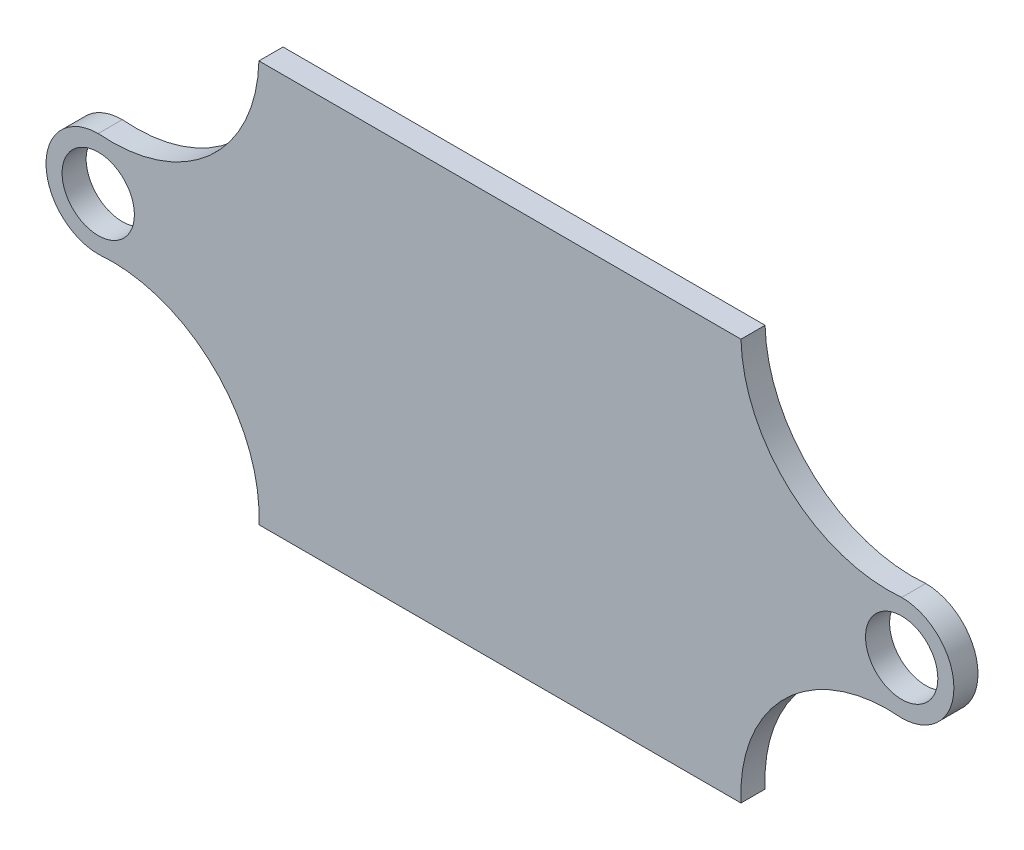
ISO-10303-21;
HEADER;
FILE_DESCRIPTION(('STEP AP214'),'2;1');
FILE_NAME('part.step','',(''),(''),'','','');
FILE_SCHEMA(('AUTOMOTIVE_DESIGN { 1 0 10303 214 1 1 1 1 }'));
ENDSEC;
DATA;
#1=APPLICATION_CONTEXT('core data for automotive mechanical design processes');
#2=APPLICATION_PROTOCOL_DEFINITION('international standard','automotive_design',2000,#1);
#3=PRODUCT_CONTEXT('',#1,'mechanical');
#4=PRODUCT('Part','Part','',(#3));
#5=PRODUCT_RELATED_PRODUCT_CATEGORY('part','',(#4));
#6=PRODUCT_DEFINITION_FORMATION('','',#4);
#7=PRODUCT_DEFINITION_CONTEXT('part definition',#1,'design');
#8=PRODUCT_DEFINITION('design','',#6,#7);
#9=PRODUCT_DEFINITION_SHAPE('','',#8);
#10=(LENGTH_UNIT() NAMED_UNIT(*) SI_UNIT(.MILLI.,.METRE.));
#11=(NAMED_UNIT(*) PLANE_ANGLE_UNIT() SI_UNIT($,.RADIAN.));
#12=(NAMED_UNIT(*) SI_UNIT($,.STERADIAN.) SOLID_ANGLE_UNIT());
#13=UNCERTAINTY_MEASURE_WITH_UNIT(LENGTH_MEASURE(1.E-05),#10,'distance_accuracy_value','');
#14=(GEOMETRIC_REPRESENTATION_CONTEXT(3) GLOBAL_UNCERTAINTY_ASSIGNED_CONTEXT((#13)) GLOBAL_UNIT_ASSIGNED_CONTEXT((#10,
#11,#12)) REPRESENTATION_CONTEXT('',''));
#15=CARTESIAN_POINT('',(0.,0.,0.));
#16=DIRECTION('',(0.,0.,1.));
#17=DIRECTION('',(1.,0.,0.));
#18=AXIS2_PLACEMENT_3D('',#15,#16,#17);
#19=CARTESIAN_POINT('',(-50.,0.665499090532171,3.));
#20=DIRECTION('',(0.,0.,-1.));
#21=DIRECTION('',(-1.,0.,0.));
#22=AXIS2_PLACEMENT_3D('',#19,#20,#21);
#23=CYLINDRICAL_SURFACE('',#22,6.5);
#24=CARTESIAN_POINT('',(-50.,0.665499090532171,0.));
#25=DIRECTION('',(0.,0.,1.));
#26=DIRECTION('',(1.,0.,0.));
#27=AXIS2_PLACEMENT_3D('',#24,#25,#26);
#28=CIRCLE('',#27,6.5);
#29=CARTESIAN_POINT('',(-50.,-5.83450090946783,0.));
#30=VERTEX_POINT('',#29);
#31=CARTESIAN_POINT('',(-50.,7.16549909053217,0.));
#32=VERTEX_POINT('',#31);
#33=EDGE_CURVE('E151',#30,#32,#28,.F.);
#34=ORIENTED_EDGE('',*,*,#33,.F.);
#35=DIRECTION('',(0.,0.,-1.));
#36=VECTOR('',#35,1.);
#37=CARTESIAN_POINT('',(-50.,-5.83450090946783,3.));
#38=LINE('',#37,#36);
#39=CARTESIAN_POINT('',(-50.,-5.83450090946783,3.));
#40=VERTEX_POINT('',#39);
#41=EDGE_CURVE('E11',#40,#30,#38,.T.);
#42=ORIENTED_EDGE('',*,*,#41,.F.);
#43=CARTESIAN_POINT('',(-50.,0.665499090532171,3.));
#44=DIRECTION('',(0.,0.,1.));
#45=DIRECTION('',(1.,0.,0.));
#46=AXIS2_PLACEMENT_3D('',#43,#44,#45);
#47=CIRCLE('',#46,6.5);
#48=CARTESIAN_POINT('',(-50.,7.16549909053217,3.));
#49=VERTEX_POINT('',#48);
#50=EDGE_CURVE('E185',#40,#49,#47,.F.);
#51=ORIENTED_EDGE('',*,*,#50,.T.);
#52=DIRECTION('',(0.,0.,-1.));
#53=VECTOR('',#52,1.);
#54=CARTESIAN_POINT('',(-50.,7.16549909053217,3.));
#55=LINE('',#54,#53);
#56=EDGE_CURVE('E96',#49,#32,#55,.T.);
#57=ORIENTED_EDGE('',*,*,#56,.T.);
#58=EDGE_LOOP('',(#34,#42,#51,#57));
#59=FACE_BOUND('',#58,.T.);
#60=ADVANCED_FACE('F45',(#59),#23,.T.);
#61=CARTESIAN_POINT('',(-48.3223116440024,-24.10193078024,3.));
#62=DIRECTION('',(0.,0.,-1.));
#63=DIRECTION('',(-1.,0.,0.));
#64=AXIS2_PLACEMENT_3D('',#61,#62,#63);
#65=CYLINDRICAL_SURFACE('',#64,18.3443078992757);
#66=CARTESIAN_POINT('',(-48.3223116440024,-24.10193078024,0.));
#67=DIRECTION('',(0.,0.,1.));
#68=DIRECTION('',(1.,0.,0.));
#69=AXIS2_PLACEMENT_3D('',#66,#67,#68);
#70=CIRCLE('',#69,18.3443078992757);
#71=CARTESIAN_POINT('',(-30.,-25.,0.));
#72=VERTEX_POINT('',#71);
#73=EDGE_CURVE('E155',#72,#30,#70,.T.);
#74=ORIENTED_EDGE('',*,*,#73,.F.);
#75=DIRECTION('',(0.,0.,-1.));
#76=VECTOR('',#75,1.);
#77=CARTESIAN_POINT('',(-30.,-25.,3.));
#78=LINE('',#77,#76);
#79=CARTESIAN_POINT('',(-30.,-25.,3.));
#80=VERTEX_POINT('',#79);
#81=EDGE_CURVE('E54',#80,#72,#78,.T.);
#82=ORIENTED_EDGE('',*,*,#81,.F.);
#83=CARTESIAN_POINT('',(-48.3223116440024,-24.10193078024,3.));
#84=DIRECTION('',(0.,0.,1.));
#85=DIRECTION('',(1.,0.,0.));
#86=AXIS2_PLACEMENT_3D('',#83,#84,#85);
#87=CIRCLE('',#86,18.3443078992757);
#88=EDGE_CURVE('E216',#80,#40,#87,.T.);
#89=ORIENTED_EDGE('',*,*,#88,.T.);
#90=ORIENTED_EDGE('',*,*,#41,.T.);
#91=EDGE_LOOP('',(#74,#82,#89,#90));
#92=FACE_BOUND('',#91,.T.);
#93=ADVANCED_FACE('F215',(#92),#65,.F.);
#94=CARTESIAN_POINT('',(0.,-25.,3.));
#95=DIRECTION('',(0.,1.,0.));
#96=DIRECTION('',(-1.,0.,0.));
#97=AXIS2_PLACEMENT_3D('',#94,#95,#96);
#98=PLANE('',#97);
#99=DIRECTION('',(1.,0.,0.));
#100=VECTOR('',#99,1.);
#101=CARTESIAN_POINT('',(0.,-25.,0.));
#102=LINE('',#101,#100);
#103=CARTESIAN_POINT('',(30.,-25.,0.));
#104=VERTEX_POINT('',#103);
#105=EDGE_CURVE('E159',#72,#104,#102,.T.);
#106=ORIENTED_EDGE('',*,*,#105,.T.);
#107=DIRECTION('',(0.,0.,-1.));
#108=VECTOR('',#107,1.);
#109=CARTESIAN_POINT('',(30.,-25.,3.));
#110=LINE('',#109,#108);
#111=CARTESIAN_POINT('',(30.,-25.,3.));
#112=VERTEX_POINT('',#111);
#113=EDGE_CURVE('E196',#112,#104,#110,.T.);
#114=ORIENTED_EDGE('',*,*,#113,.F.);
#115=DIRECTION('',(1.,0.,0.));
#116=VECTOR('',#115,1.);
#117=CARTESIAN_POINT('',(0.,-25.,3.));
#118=LINE('',#117,#116);
#119=EDGE_CURVE('E205',#80,#112,#118,.T.);
#120=ORIENTED_EDGE('',*,*,#119,.F.);
#121=ORIENTED_EDGE('',*,*,#81,.T.);
#122=EDGE_LOOP('',(#106,#114,#120,#121));
#123=FACE_BOUND('',#122,.T.);
#124=ADVANCED_FACE('F203',(#123),#98,.F.);
#125=CARTESIAN_POINT('',(48.3223116440025,-24.10193078024,3.));
#126=DIRECTION('',(0.,0.,-1.));
#127=DIRECTION('',(-1.,0.,0.));
#128=AXIS2_PLACEMENT_3D('',#125,#126,#127);
#129=CYLINDRICAL_SURFACE('',#128,18.3443078992757);
#130=CARTESIAN_POINT('',(48.3223116440025,-24.10193078024,0.));
#131=DIRECTION('',(0.,0.,1.));
#132=DIRECTION('',(1.,0.,0.));
#133=AXIS2_PLACEMENT_3D('',#130,#131,#132);
#134=CIRCLE('',#133,18.3443078992757);
#135=CARTESIAN_POINT('',(50.,-5.83450090946782,0.));
#136=VERTEX_POINT('',#135);
#137=EDGE_CURVE('E162',#104,#136,#134,.F.);
#138=ORIENTED_EDGE('',*,*,#137,.T.);
#139=DIRECTION('',(0.,0.,-1.));
#140=VECTOR('',#139,1.);
#141=CARTESIAN_POINT('',(50.,-5.83450090946782,3.));
#142=LINE('',#141,#140);
#143=CARTESIAN_POINT('',(50.,-5.83450090946782,3.));
#144=VERTEX_POINT('',#143);
#145=EDGE_CURVE('E192',#144,#136,#142,.T.);
#146=ORIENTED_EDGE('',*,*,#145,.F.);
#147=CARTESIAN_POINT('',(48.3223116440025,-24.10193078024,3.));
#148=DIRECTION('',(0.,0.,1.));
#149=DIRECTION('',(1.,0.,0.));
#150=AXIS2_PLACEMENT_3D('',#147,#148,#149);
#151=CIRCLE('',#150,18.3443078992757);
#152=EDGE_CURVE('E225',#112,#144,#151,.F.);
#153=ORIENTED_EDGE('',*,*,#152,.F.);
#154=ORIENTED_EDGE('',*,*,#113,.T.);
#155=EDGE_LOOP('',(#138,#146,#153,#154));
#156=FACE_BOUND('',#155,.T.);
#157=ADVANCED_FACE('F231',(#156),#129,.F.);
#158=CARTESIAN_POINT('',(50.,0.665499090532183,3.));
#159=DIRECTION('',(0.,0.,-1.));
#160=DIRECTION('',(-1.,0.,0.));
#161=AXIS2_PLACEMENT_3D('',#158,#159,#160);
#162=CYLINDRICAL_SURFACE('',#161,6.5);
#163=CARTESIAN_POINT('',(50.,0.665499090532183,0.));
#164=DIRECTION('',(0.,0.,1.));
#165=DIRECTION('',(1.,0.,0.));
#166=AXIS2_PLACEMENT_3D('',#163,#164,#165);
#167=CIRCLE('',#166,6.5);
#168=CARTESIAN_POINT('',(50.,7.16549909053218,0.));
#169=VERTEX_POINT('',#168);
#170=EDGE_CURVE('E165',#136,#169,#167,.T.);
#171=ORIENTED_EDGE('',*,*,#170,.T.);
#172=DIRECTION('',(0.,0.,-1.));
#173=VECTOR('',#172,1.);
#174=CARTESIAN_POINT('',(50.,7.16549909053218,3.));
#175=LINE('',#174,#173);
#176=CARTESIAN_POINT('',(50.,7.16549909053218,3.));
#177=VERTEX_POINT('',#176);
#178=EDGE_CURVE('E126',#177,#169,#175,.T.);
#179=ORIENTED_EDGE('',*,*,#178,.F.);
#180=CARTESIAN_POINT('',(50.,0.665499090532183,3.));
#181=DIRECTION('',(0.,0.,1.));
#182=DIRECTION('',(1.,0.,0.));
#183=AXIS2_PLACEMENT_3D('',#180,#181,#182);
#184=CIRCLE('',#183,6.5);
#185=EDGE_CURVE('E132',#144,#177,#184,.T.);
#186=ORIENTED_EDGE('',*,*,#185,.F.);
#187=ORIENTED_EDGE('',*,*,#145,.T.);
#188=EDGE_LOOP('',(#171,#179,#186,#187));
#189=FACE_BOUND('',#188,.T.);
#190=ADVANCED_FACE('F233',(#189),#162,.T.);
#191=CARTESIAN_POINT('',(48.339162174585,25.4344686843848,3.));
#192=DIRECTION('',(0.,0.,-1.));
#193=DIRECTION('',(-1.,0.,0.));
#194=AXIS2_PLACEMENT_3D('',#191,#192,#193);
#195=CYLINDRICAL_SURFACE('',#194,18.344307899276);
#196=CARTESIAN_POINT('',(48.339162174585,25.4344686843848,0.));
#197=DIRECTION('',(0.,0.,1.));
#198=DIRECTION('',(1.,0.,0.));
#199=AXIS2_PLACEMENT_3D('',#196,#197,#198);
#200=CIRCLE('',#199,18.344307899276);
#201=CARTESIAN_POINT('',(30.,25.,0.));
#202=VERTEX_POINT('',#201);
#203=EDGE_CURVE('E120',#202,#169,#200,.T.);
#204=ORIENTED_EDGE('',*,*,#203,.F.);
#205=DIRECTION('',(0.,0.,-1.));
#206=VECTOR('',#205,1.);
#207=CARTESIAN_POINT('',(30.,25.,3.));
#208=LINE('',#207,#206);
#209=CARTESIAN_POINT('',(30.,25.,3.));
#210=VERTEX_POINT('',#209);
#211=EDGE_CURVE('E115',#210,#202,#208,.T.);
#212=ORIENTED_EDGE('',*,*,#211,.F.);
#213=CARTESIAN_POINT('',(48.339162174585,25.4344686843848,3.));
#214=DIRECTION('',(0.,0.,1.));
#215=DIRECTION('',(1.,0.,0.));
#216=AXIS2_PLACEMENT_3D('',#213,#214,#215);
#217=CIRCLE('',#216,18.344307899276);
#218=EDGE_CURVE('E118',#210,#177,#217,.T.);
#219=ORIENTED_EDGE('',*,*,#218,.T.);
#220=ORIENTED_EDGE('',*,*,#178,.T.);
#221=EDGE_LOOP('',(#204,#212,#219,#220));
#222=FACE_BOUND('',#221,.T.);
#223=ADVANCED_FACE('F117',(#222),#195,.F.);
#224=CARTESIAN_POINT('',(0.,25.,3.));
#225=DIRECTION('',(0.,1.,0.));
#226=DIRECTION('',(-1.,0.,0.));
#227=AXIS2_PLACEMENT_3D('',#224,#225,#226);
#228=PLANE('',#227);
#229=DIRECTION('',(1.,0.,0.));
#230=VECTOR('',#229,1.);
#231=CARTESIAN_POINT('',(0.,25.,0.));
#232=LINE('',#231,#230);
#233=CARTESIAN_POINT('',(-30.,25.,0.));
#234=VERTEX_POINT('',#233);
#235=EDGE_CURVE('E171',#234,#202,#232,.T.);
#236=ORIENTED_EDGE('',*,*,#235,.F.);
#237=DIRECTION('',(0.,0.,-1.));
#238=VECTOR('',#237,1.);
#239=CARTESIAN_POINT('',(-30.,25.,3.));
#240=LINE('',#239,#238);
#241=CARTESIAN_POINT('',(-30.,25.,3.));
#242=VERTEX_POINT('',#241);
#243=EDGE_CURVE('E89',#242,#234,#240,.T.);
#244=ORIENTED_EDGE('',*,*,#243,.F.);
#245=DIRECTION('',(1.,0.,0.));
#246=VECTOR('',#245,1.);
#247=CARTESIAN_POINT('',(0.,25.,3.));
#248=LINE('',#247,#246);
#249=EDGE_CURVE('E130',#242,#210,#248,.T.);
#250=ORIENTED_EDGE('',*,*,#249,.T.);
#251=ORIENTED_EDGE('',*,*,#211,.T.);
#252=EDGE_LOOP('',(#236,#244,#250,#251));
#253=FACE_BOUND('',#252,.T.);
#254=ADVANCED_FACE('F136',(#253),#228,.T.);
#255=CARTESIAN_POINT('',(50.,0.665499090532183,3.));
#256=DIRECTION('',(0.,0.,-1.));
#257=DIRECTION('',(-1.,0.,0.));
#258=AXIS2_PLACEMENT_3D('',#255,#256,#257);
#259=CYLINDRICAL_SURFACE('',#258,4.5);
#260=CARTESIAN_POINT('',(50.,0.665499090532183,3.));
#261=DIRECTION('',(0.,0.,1.));
#262=DIRECTION('',(1.,0.,0.));
#263=AXIS2_PLACEMENT_3D('',#260,#261,#262);
#264=CIRCLE('',#263,4.5);
#265=CARTESIAN_POINT('',(54.5,0.665499090532183,3.));
#266=VERTEX_POINT('',#265);
#267=EDGE_CURVE('E140',#266,#266,#264,.T.);
#268=ORIENTED_EDGE('',*,*,#267,.T.);
#269=EDGE_LOOP('',(#268));
#270=FACE_BOUND('',#269,.T.);
#271=CARTESIAN_POINT('',(50.,0.665499090532183,0.));
#272=DIRECTION('',(0.,0.,1.));
#273=DIRECTION('',(1.,0.,0.));
#274=AXIS2_PLACEMENT_3D('',#271,#272,#273);
#275=CIRCLE('',#274,4.5);
#276=CARTESIAN_POINT('',(54.5,0.665499090532183,0.));
#277=VERTEX_POINT('',#276);
#278=EDGE_CURVE('E177',#277,#277,#275,.T.);
#279=ORIENTED_EDGE('',*,*,#278,.F.);
#280=EDGE_LOOP('',(#279));
#281=FACE_BOUND('',#280,.T.);
#282=ADVANCED_FACE('F278',(#270,#281),#259,.F.);
#283=CARTESIAN_POINT('',(-48.339162174585,25.4344686843847,3.));
#284=DIRECTION('',(0.,0.,-1.));
#285=DIRECTION('',(-1.,0.,0.));
#286=AXIS2_PLACEMENT_3D('',#283,#284,#285);
#287=CYLINDRICAL_SURFACE('',#286,18.344307899276);
#288=CARTESIAN_POINT('',(-48.339162174585,25.4344686843847,0.));
#289=DIRECTION('',(0.,0.,1.));
#290=DIRECTION('',(1.,0.,0.));
#291=AXIS2_PLACEMENT_3D('',#288,#289,#290);
#292=CIRCLE('',#291,18.344307899276);
#293=EDGE_CURVE('E174',#234,#32,#292,.F.);
#294=ORIENTED_EDGE('',*,*,#293,.T.);
#295=ORIENTED_EDGE('',*,*,#56,.F.);
#296=CARTESIAN_POINT('',(-48.339162174585,25.4344686843847,3.));
#297=DIRECTION('',(0.,0.,1.));
#298=DIRECTION('',(1.,0.,0.));
#299=AXIS2_PLACEMENT_3D('',#296,#297,#298);
#300=CIRCLE('',#299,18.344307899276);
#301=EDGE_CURVE('E62',#242,#49,#300,.F.);
#302=ORIENTED_EDGE('',*,*,#301,.F.);
#303=ORIENTED_EDGE('',*,*,#243,.T.);
#304=EDGE_LOOP('',(#294,#295,#302,#303));
#305=FACE_BOUND('',#304,.T.);
#306=ADVANCED_FACE('F217',(#305),#287,.F.);
#307=CARTESIAN_POINT('',(-50.,0.665499090532171,3.));
#308=DIRECTION('',(0.,0.,-1.));
#309=DIRECTION('',(-1.,0.,0.));
#310=AXIS2_PLACEMENT_3D('',#307,#308,#309);
#311=CYLINDRICAL_SURFACE('',#310,4.5);
#312=CARTESIAN_POINT('',(-50.,0.665499090532171,3.));
#313=DIRECTION('',(0.,0.,1.));
#314=DIRECTION('',(1.,0.,0.));
#315=AXIS2_PLACEMENT_3D('',#312,#313,#314);
#316=CIRCLE('',#315,4.5);
#317=CARTESIAN_POINT('',(-45.5,0.665499090532171,3.));
#318=VERTEX_POINT('',#317);
#319=EDGE_CURVE('E147',#318,#318,#316,.F.);
#320=ORIENTED_EDGE('',*,*,#319,.F.);
#321=EDGE_LOOP('',(#320));
#322=FACE_BOUND('',#321,.T.);
#323=CARTESIAN_POINT('',(-50.,0.665499090532171,0.));
#324=DIRECTION('',(0.,0.,1.));
#325=DIRECTION('',(1.,0.,0.));
#326=AXIS2_PLACEMENT_3D('',#323,#324,#325);
#327=CIRCLE('',#326,4.5);
#328=CARTESIAN_POINT('',(-45.5,0.665499090532171,0.));
#329=VERTEX_POINT('',#328);
#330=EDGE_CURVE('E181',#329,#329,#327,.F.);
#331=ORIENTED_EDGE('',*,*,#330,.T.);
#332=EDGE_LOOP('',(#331));
#333=FACE_BOUND('',#332,.T.);
#334=ADVANCED_FACE('F298',(#322,#333),#311,.F.);
#335=CARTESIAN_POINT('',(0.,0.,3.));
#336=DIRECTION('',(0.,0.,1.));
#337=DIRECTION('',(1.,0.,0.));
#338=AXIS2_PLACEMENT_3D('',#335,#336,#337);
#339=PLANE('',#338);
#340=ORIENTED_EDGE('',*,*,#50,.F.);
#341=ORIENTED_EDGE('',*,*,#88,.F.);
#342=ORIENTED_EDGE('',*,*,#119,.T.);
#343=ORIENTED_EDGE('',*,*,#152,.T.);
#344=ORIENTED_EDGE('',*,*,#185,.T.);
#345=ORIENTED_EDGE('',*,*,#218,.F.);
#346=ORIENTED_EDGE('',*,*,#249,.F.);
#347=ORIENTED_EDGE('',*,*,#301,.T.);
#348=EDGE_LOOP('',(#340,#341,#342,#343,#344,#345,#346,#347));
#349=FACE_BOUND('',#348,.T.);
#350=ORIENTED_EDGE('',*,*,#267,.F.);
#351=EDGE_LOOP('',(#350));
#352=FACE_BOUND('',#351,.T.);
#353=ORIENTED_EDGE('',*,*,#319,.T.);
#354=EDGE_LOOP('',(#353));
#355=FACE_BOUND('',#354,.T.);
#356=ADVANCED_FACE('F128',(#349,#352,#355),#339,.T.);
#357=CARTESIAN_POINT('',(0.,0.,0.));
#358=DIRECTION('',(0.,0.,1.));
#359=DIRECTION('',(1.,0.,0.));
#360=AXIS2_PLACEMENT_3D('',#357,#358,#359);
#361=PLANE('',#360);
#362=ORIENTED_EDGE('',*,*,#33,.T.);
#363=ORIENTED_EDGE('',*,*,#293,.F.);
#364=ORIENTED_EDGE('',*,*,#235,.T.);
#365=ORIENTED_EDGE('',*,*,#203,.T.);
#366=ORIENTED_EDGE('',*,*,#170,.F.);
#367=ORIENTED_EDGE('',*,*,#137,.F.);
#368=ORIENTED_EDGE('',*,*,#105,.F.);
#369=ORIENTED_EDGE('',*,*,#73,.T.);
#370=EDGE_LOOP('',(#362,#363,#364,#365,#366,#367,#368,#369));
#371=FACE_BOUND('',#370,.T.);
#372=ORIENTED_EDGE('',*,*,#278,.T.);
#373=EDGE_LOOP('',(#372));
#374=FACE_BOUND('',#373,.T.);
#375=ORIENTED_EDGE('',*,*,#330,.F.);
#376=EDGE_LOOP('',(#375));
#377=FACE_BOUND('',#376,.T.);
#378=ADVANCED_FACE('F212',(#371,#374,#377),#361,.F.);
#379=CLOSED_SHELL('',(#60,#93,#124,#157,#190,#223,#254,#282,#306,#334,#356,#378));
#380=MANIFOLD_SOLID_BREP('B2',#379);
#381=ADVANCED_BREP_SHAPE_REPRESENTATION('',(#18,#380),#14);
#382=SHAPE_DEFINITION_REPRESENTATION(#9,#381);
ENDSEC;
END-ISO-10303-21;
